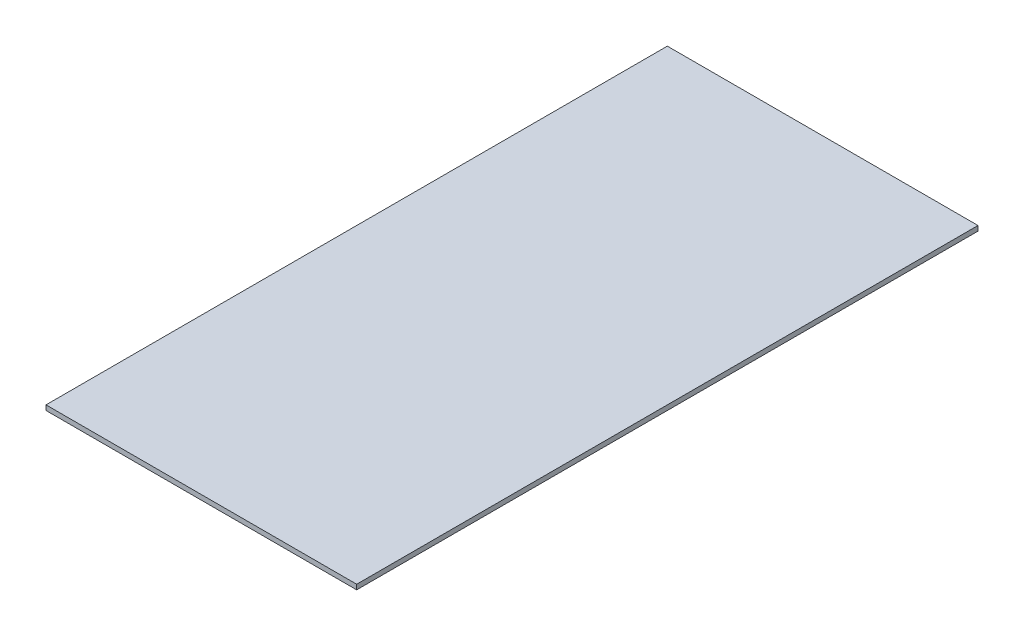
ISO-10303-21;
HEADER;
FILE_DESCRIPTION(('STEP AP214'),'2;1');
FILE_NAME('part.step','',(''),(''),'','','');
FILE_SCHEMA(('AUTOMOTIVE_DESIGN { 1 0 10303 214 1 1 1 1 }'));
ENDSEC;
DATA;
#1=APPLICATION_CONTEXT('core data for automotive mechanical design processes');
#2=APPLICATION_PROTOCOL_DEFINITION('international standard','automotive_design',2000,#1);
#3=PRODUCT_CONTEXT('',#1,'mechanical');
#4=PRODUCT('Part','Part','',(#3));
#5=PRODUCT_RELATED_PRODUCT_CATEGORY('part','',(#4));
#6=PRODUCT_DEFINITION_FORMATION('','',#4);
#7=PRODUCT_DEFINITION_CONTEXT('part definition',#1,'design');
#8=PRODUCT_DEFINITION('design','',#6,#7);
#9=PRODUCT_DEFINITION_SHAPE('','',#8);
#10=(LENGTH_UNIT() NAMED_UNIT(*) SI_UNIT(.MILLI.,.METRE.));
#11=(NAMED_UNIT(*) PLANE_ANGLE_UNIT() SI_UNIT($,.RADIAN.));
#12=(NAMED_UNIT(*) SI_UNIT($,.STERADIAN.) SOLID_ANGLE_UNIT());
#13=UNCERTAINTY_MEASURE_WITH_UNIT(LENGTH_MEASURE(1.E-05),#10,'distance_accuracy_value','');
#14=(GEOMETRIC_REPRESENTATION_CONTEXT(3) GLOBAL_UNCERTAINTY_ASSIGNED_CONTEXT((#13)) GLOBAL_UNIT_ASSIGNED_CONTEXT((#10,
#11,#12)) REPRESENTATION_CONTEXT('',''));
#15=CARTESIAN_POINT('',(0.,0.,0.));
#16=DIRECTION('',(0.,0.,1.));
#17=DIRECTION('',(1.,0.,0.));
#18=AXIS2_PLACEMENT_3D('',#15,#16,#17);
#19=CARTESIAN_POINT('',(-47.5,-1.5,-190.));
#20=DIRECTION('',(-1.,0.,0.));
#21=DIRECTION('',(0.,0.,1.));
#22=AXIS2_PLACEMENT_3D('',#19,#20,#21);
#23=PLANE('',#22);
#24=DIRECTION('',(0.,0.,1.));
#25=VECTOR('',#24,1.);
#26=CARTESIAN_POINT('',(-47.5,0.,-190.));
#27=LINE('',#26,#25);
#28=CARTESIAN_POINT('',(-47.5,0.,-190.));
#29=VERTEX_POINT('',#28);
#30=CARTESIAN_POINT('',(-47.5,0.,0.));
#31=VERTEX_POINT('',#30);
#32=EDGE_CURVE('E94',#29,#31,#27,.T.);
#33=ORIENTED_EDGE('',*,*,#32,.F.);
#34=DIRECTION('',(0.,1.,0.));
#35=VECTOR('',#34,1.);
#36=CARTESIAN_POINT('',(-47.5,-1.5,-190.));
#37=LINE('',#36,#35);
#38=CARTESIAN_POINT('',(-47.5,-1.5,-190.));
#39=VERTEX_POINT('',#38);
#40=EDGE_CURVE('E11',#39,#29,#37,.T.);
#41=ORIENTED_EDGE('',*,*,#40,.F.);
#42=DIRECTION('',(0.,0.,1.));
#43=VECTOR('',#42,1.);
#44=CARTESIAN_POINT('',(-47.5,-1.5,-190.));
#45=LINE('',#44,#43);
#46=CARTESIAN_POINT('',(-47.5,-1.5,0.));
#47=VERTEX_POINT('',#46);
#48=EDGE_CURVE('E88',#39,#47,#45,.T.);
#49=ORIENTED_EDGE('',*,*,#48,.T.);
#50=DIRECTION('',(0.,1.,0.));
#51=VECTOR('',#50,1.);
#52=CARTESIAN_POINT('',(-47.5,-1.5,0.));
#53=LINE('',#52,#51);
#54=EDGE_CURVE('E33',#47,#31,#53,.T.);
#55=ORIENTED_EDGE('',*,*,#54,.T.);
#56=EDGE_LOOP('',(#33,#41,#49,#55));
#57=FACE_BOUND('',#56,.T.);
#58=ADVANCED_FACE('F30',(#57),#23,.T.);
#59=CARTESIAN_POINT('',(-47.5,-1.5,-190.));
#60=DIRECTION('',(0.,0.,-1.));
#61=DIRECTION('',(-1.,0.,0.));
#62=AXIS2_PLACEMENT_3D('',#59,#60,#61);
#63=PLANE('',#62);
#64=DIRECTION('',(-1.,0.,0.));
#65=VECTOR('',#64,1.);
#66=CARTESIAN_POINT('',(-47.5,0.,-190.));
#67=LINE('',#66,#65);
#68=CARTESIAN_POINT('',(47.5,0.,-190.));
#69=VERTEX_POINT('',#68);
#70=EDGE_CURVE('E90',#69,#29,#67,.T.);
#71=ORIENTED_EDGE('',*,*,#70,.F.);
#72=DIRECTION('',(0.,1.,0.));
#73=VECTOR('',#72,1.);
#74=CARTESIAN_POINT('',(47.5,-1.5,-190.));
#75=LINE('',#74,#73);
#76=CARTESIAN_POINT('',(47.5,-1.5,-190.));
#77=VERTEX_POINT('',#76);
#78=EDGE_CURVE('E39',#77,#69,#75,.T.);
#79=ORIENTED_EDGE('',*,*,#78,.F.);
#80=DIRECTION('',(-1.,0.,0.));
#81=VECTOR('',#80,1.);
#82=CARTESIAN_POINT('',(-47.5,-1.5,-190.));
#83=LINE('',#82,#81);
#84=EDGE_CURVE('E85',#77,#39,#83,.T.);
#85=ORIENTED_EDGE('',*,*,#84,.T.);
#86=ORIENTED_EDGE('',*,*,#40,.T.);
#87=EDGE_LOOP('',(#71,#79,#85,#86));
#88=FACE_BOUND('',#87,.T.);
#89=ADVANCED_FACE('F104',(#88),#63,.T.);
#90=CARTESIAN_POINT('',(47.5,-1.5,-190.));
#91=DIRECTION('',(1.,0.,0.));
#92=DIRECTION('',(0.,0.,-1.));
#93=AXIS2_PLACEMENT_3D('',#90,#91,#92);
#94=PLANE('',#93);
#95=DIRECTION('',(0.,0.,-1.));
#96=VECTOR('',#95,1.);
#97=CARTESIAN_POINT('',(47.5,0.,-190.));
#98=LINE('',#97,#96);
#99=CARTESIAN_POINT('',(47.5,0.,0.));
#100=VERTEX_POINT('',#99);
#101=EDGE_CURVE('E80',#100,#69,#98,.T.);
#102=ORIENTED_EDGE('',*,*,#101,.F.);
#103=DIRECTION('',(0.,1.,0.));
#104=VECTOR('',#103,1.);
#105=CARTESIAN_POINT('',(47.5,-1.5,0.));
#106=LINE('',#105,#104);
#107=CARTESIAN_POINT('',(47.5,-1.5,0.));
#108=VERTEX_POINT('',#107);
#109=EDGE_CURVE('E75',#108,#100,#106,.T.);
#110=ORIENTED_EDGE('',*,*,#109,.F.);
#111=DIRECTION('',(0.,0.,-1.));
#112=VECTOR('',#111,1.);
#113=CARTESIAN_POINT('',(47.5,-1.5,-190.));
#114=LINE('',#113,#112);
#115=EDGE_CURVE('E78',#108,#77,#114,.T.);
#116=ORIENTED_EDGE('',*,*,#115,.T.);
#117=ORIENTED_EDGE('',*,*,#78,.T.);
#118=EDGE_LOOP('',(#102,#110,#116,#117));
#119=FACE_BOUND('',#118,.T.);
#120=ADVANCED_FACE('F77',(#119),#94,.T.);
#121=CARTESIAN_POINT('',(-47.5,-1.5,0.));
#122=DIRECTION('',(0.,0.,1.));
#123=DIRECTION('',(1.,0.,0.));
#124=AXIS2_PLACEMENT_3D('',#121,#122,#123);
#125=PLANE('',#124);
#126=DIRECTION('',(1.,0.,0.));
#127=VECTOR('',#126,1.);
#128=CARTESIAN_POINT('',(-47.5,0.,0.));
#129=LINE('',#128,#127);
#130=EDGE_CURVE('E97',#31,#100,#129,.T.);
#131=ORIENTED_EDGE('',*,*,#130,.F.);
#132=ORIENTED_EDGE('',*,*,#54,.F.);
#133=DIRECTION('',(1.,0.,0.));
#134=VECTOR('',#133,1.);
#135=CARTESIAN_POINT('',(-47.5,-1.5,0.));
#136=LINE('',#135,#134);
#137=EDGE_CURVE('E84',#47,#108,#136,.T.);
#138=ORIENTED_EDGE('',*,*,#137,.T.);
#139=ORIENTED_EDGE('',*,*,#109,.T.);
#140=EDGE_LOOP('',(#131,#132,#138,#139));
#141=FACE_BOUND('',#140,.T.);
#142=ADVANCED_FACE('F87',(#141),#125,.T.);
#143=CARTESIAN_POINT('',(-47.5,-1.5,-190.));
#144=DIRECTION('',(0.,1.,0.));
#145=DIRECTION('',(0.,0.,1.));
#146=AXIS2_PLACEMENT_3D('',#143,#144,#145);
#147=PLANE('',#146);
#148=ORIENTED_EDGE('',*,*,#48,.F.);
#149=ORIENTED_EDGE('',*,*,#84,.F.);
#150=ORIENTED_EDGE('',*,*,#115,.F.);
#151=ORIENTED_EDGE('',*,*,#137,.F.);
#152=EDGE_LOOP('',(#148,#149,#150,#151));
#153=FACE_BOUND('',#152,.T.);
#154=ADVANCED_FACE('F83',(#153),#147,.F.);
#155=CARTESIAN_POINT('',(-47.5,0.,-190.));
#156=DIRECTION('',(0.,1.,0.));
#157=DIRECTION('',(0.,0.,1.));
#158=AXIS2_PLACEMENT_3D('',#155,#156,#157);
#159=PLANE('',#158);
#160=ORIENTED_EDGE('',*,*,#32,.T.);
#161=ORIENTED_EDGE('',*,*,#130,.T.);
#162=ORIENTED_EDGE('',*,*,#101,.T.);
#163=ORIENTED_EDGE('',*,*,#70,.T.);
#164=EDGE_LOOP('',(#160,#161,#162,#163));
#165=FACE_BOUND('',#164,.T.);
#166=ADVANCED_FACE('F103',(#165),#159,.T.);
#167=CLOSED_SHELL('',(#58,#89,#120,#142,#154,#166));
#168=MANIFOLD_SOLID_BREP('B2',#167);
#169=ADVANCED_BREP_SHAPE_REPRESENTATION('',(#18,#168),#14);
#170=SHAPE_DEFINITION_REPRESENTATION(#9,#169);
ENDSEC;
END-ISO-10303-21;
